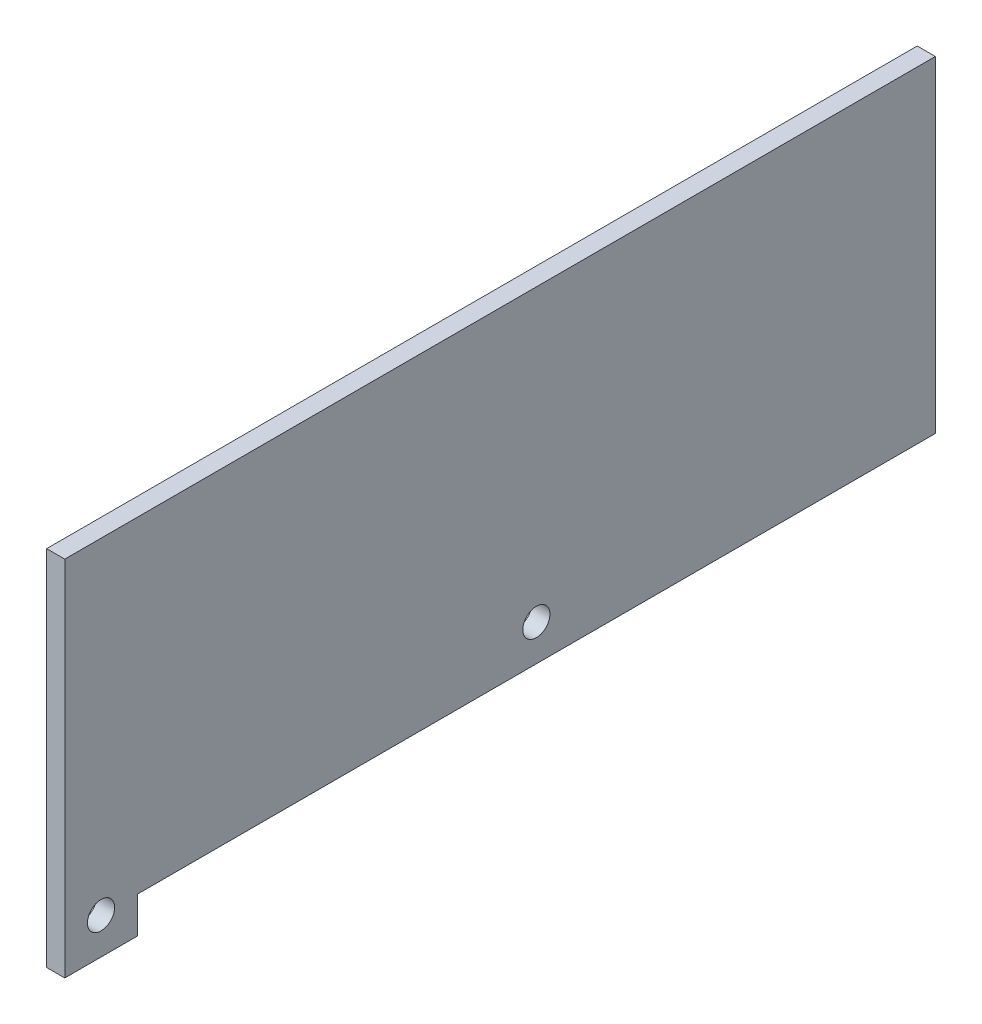
ISO-10303-21;
HEADER;
FILE_DESCRIPTION(('STEP AP214'),'2;1');
FILE_NAME('part.step','',(''),(''),'','','');
FILE_SCHEMA(('AUTOMOTIVE_DESIGN { 1 0 10303 214 1 1 1 1 }'));
ENDSEC;
DATA;
#1=APPLICATION_CONTEXT('core data for automotive mechanical design processes');
#2=APPLICATION_PROTOCOL_DEFINITION('international standard','automotive_design',2000,#1);
#3=PRODUCT_CONTEXT('',#1,'mechanical');
#4=PRODUCT('Part','Part','',(#3));
#5=PRODUCT_RELATED_PRODUCT_CATEGORY('part','',(#4));
#6=PRODUCT_DEFINITION_FORMATION('','',#4);
#7=PRODUCT_DEFINITION_CONTEXT('part definition',#1,'design');
#8=PRODUCT_DEFINITION('design','',#6,#7);
#9=PRODUCT_DEFINITION_SHAPE('','',#8);
#10=(LENGTH_UNIT() NAMED_UNIT(*) SI_UNIT(.MILLI.,.METRE.));
#11=(NAMED_UNIT(*) PLANE_ANGLE_UNIT() SI_UNIT($,.RADIAN.));
#12=(NAMED_UNIT(*) SI_UNIT($,.STERADIAN.) SOLID_ANGLE_UNIT());
#13=UNCERTAINTY_MEASURE_WITH_UNIT(LENGTH_MEASURE(1.E-05),#10,'distance_accuracy_value','');
#14=(GEOMETRIC_REPRESENTATION_CONTEXT(3) GLOBAL_UNCERTAINTY_ASSIGNED_CONTEXT((#13)) GLOBAL_UNIT_ASSIGNED_CONTEXT((#10,
#11,#12)) REPRESENTATION_CONTEXT('',''));
#15=CARTESIAN_POINT('',(0.,0.,0.));
#16=DIRECTION('',(0.,0.,1.));
#17=DIRECTION('',(1.,0.,0.));
#18=AXIS2_PLACEMENT_3D('',#15,#16,#17);
#19=CARTESIAN_POINT('',(6.35,254.,0.));
#20=DIRECTION('',(0.,0.,-1.));
#21=DIRECTION('',(0.,1.,0.));
#22=AXIS2_PLACEMENT_3D('',#19,#20,#21);
#23=PLANE('',#22);
#24=DIRECTION('',(0.,-1.,0.));
#25=VECTOR('',#24,1.);
#26=CARTESIAN_POINT('',(-6.35,254.,0.));
#27=LINE('',#26,#25);
#28=CARTESIAN_POINT('',(-6.35,254.,0.));
#29=VERTEX_POINT('',#28);
#30=CARTESIAN_POINT('',(-6.35,0.,0.));
#31=VERTEX_POINT('',#30);
#32=EDGE_CURVE('E117',#29,#31,#27,.T.);
#33=ORIENTED_EDGE('',*,*,#32,.T.);
#34=DIRECTION('',(-1.,0.,0.));
#35=VECTOR('',#34,1.);
#36=CARTESIAN_POINT('',(6.35,0.,0.));
#37=LINE('',#36,#35);
#38=CARTESIAN_POINT('',(6.35,0.,0.));
#39=VERTEX_POINT('',#38);
#40=EDGE_CURVE('E11',#39,#31,#37,.T.);
#41=ORIENTED_EDGE('',*,*,#40,.F.);
#42=DIRECTION('',(0.,-1.,0.));
#43=VECTOR('',#42,1.);
#44=CARTESIAN_POINT('',(6.35,254.,0.));
#45=LINE('',#44,#43);
#46=CARTESIAN_POINT('',(6.35,254.,0.));
#47=VERTEX_POINT('',#46);
#48=EDGE_CURVE('E128',#47,#39,#45,.T.);
#49=ORIENTED_EDGE('',*,*,#48,.F.);
#50=DIRECTION('',(-1.,0.,0.));
#51=VECTOR('',#50,1.);
#52=CARTESIAN_POINT('',(6.35,254.,0.));
#53=LINE('',#52,#51);
#54=EDGE_CURVE('E113',#47,#29,#53,.T.);
#55=ORIENTED_EDGE('',*,*,#54,.T.);
#56=EDGE_LOOP('',(#33,#41,#49,#55));
#57=FACE_BOUND('',#56,.T.);
#58=ADVANCED_FACE('F33',(#57),#23,.F.);
#59=CARTESIAN_POINT('',(6.35,0.,0.));
#60=DIRECTION('',(0.,1.,0.));
#61=DIRECTION('',(0.,0.,1.));
#62=AXIS2_PLACEMENT_3D('',#59,#60,#61);
#63=PLANE('',#62);
#64=DIRECTION('',(0.,0.,-1.));
#65=VECTOR('',#64,1.);
#66=CARTESIAN_POINT('',(-6.35,0.,0.));
#67=LINE('',#66,#65);
#68=CARTESIAN_POINT('',(-6.35,0.,-50.8));
#69=VERTEX_POINT('',#68);
#70=EDGE_CURVE('E120',#31,#69,#67,.T.);
#71=ORIENTED_EDGE('',*,*,#70,.T.);
#72=DIRECTION('',(-1.,0.,0.));
#73=VECTOR('',#72,1.);
#74=CARTESIAN_POINT('',(6.35,0.,-50.8));
#75=LINE('',#74,#73);
#76=CARTESIAN_POINT('',(6.35,0.,-50.8));
#77=VERTEX_POINT('',#76);
#78=EDGE_CURVE('E41',#77,#69,#75,.T.);
#79=ORIENTED_EDGE('',*,*,#78,.F.);
#80=DIRECTION('',(0.,0.,-1.));
#81=VECTOR('',#80,1.);
#82=CARTESIAN_POINT('',(6.35,0.,0.));
#83=LINE('',#82,#81);
#84=EDGE_CURVE('E86',#39,#77,#83,.T.);
#85=ORIENTED_EDGE('',*,*,#84,.F.);
#86=ORIENTED_EDGE('',*,*,#40,.T.);
#87=EDGE_LOOP('',(#71,#79,#85,#86));
#88=FACE_BOUND('',#87,.T.);
#89=ADVANCED_FACE('F153',(#88),#63,.F.);
#90=CARTESIAN_POINT('',(6.35,0.,-50.8));
#91=DIRECTION('',(0.,0.,1.));
#92=DIRECTION('',(1.,0.,0.));
#93=AXIS2_PLACEMENT_3D('',#90,#91,#92);
#94=PLANE('',#93);
#95=DIRECTION('',(0.,1.,0.));
#96=VECTOR('',#95,1.);
#97=CARTESIAN_POINT('',(-6.35,0.,-50.8));
#98=LINE('',#97,#96);
#99=CARTESIAN_POINT('',(-6.35,25.4,-50.8));
#100=VERTEX_POINT('',#99);
#101=EDGE_CURVE('E123',#69,#100,#98,.T.);
#102=ORIENTED_EDGE('',*,*,#101,.T.);
#103=DIRECTION('',(-1.,0.,0.));
#104=VECTOR('',#103,1.);
#105=CARTESIAN_POINT('',(6.35,25.4,-50.8));
#106=LINE('',#105,#104);
#107=CARTESIAN_POINT('',(6.35,25.4,-50.8));
#108=VERTEX_POINT('',#107);
#109=EDGE_CURVE('E108',#108,#100,#106,.T.);
#110=ORIENTED_EDGE('',*,*,#109,.F.);
#111=DIRECTION('',(0.,1.,0.));
#112=VECTOR('',#111,1.);
#113=CARTESIAN_POINT('',(6.35,0.,-50.8));
#114=LINE('',#113,#112);
#115=EDGE_CURVE('E99',#77,#108,#114,.T.);
#116=ORIENTED_EDGE('',*,*,#115,.F.);
#117=ORIENTED_EDGE('',*,*,#78,.T.);
#118=EDGE_LOOP('',(#102,#110,#116,#117));
#119=FACE_BOUND('',#118,.T.);
#120=ADVANCED_FACE('F134',(#119),#94,.F.);
#121=CARTESIAN_POINT('',(6.35,25.4,-50.8));
#122=DIRECTION('',(0.,1.,0.));
#123=DIRECTION('',(0.,0.,1.));
#124=AXIS2_PLACEMENT_3D('',#121,#122,#123);
#125=PLANE('',#124);
#126=DIRECTION('',(0.,0.,-1.));
#127=VECTOR('',#126,1.);
#128=CARTESIAN_POINT('',(-6.35,25.4,-50.8));
#129=LINE('',#128,#127);
#130=CARTESIAN_POINT('',(-6.35,25.4,-609.6));
#131=VERTEX_POINT('',#130);
#132=EDGE_CURVE('E107',#100,#131,#129,.T.);
#133=ORIENTED_EDGE('',*,*,#132,.T.);
#134=DIRECTION('',(-1.,0.,0.));
#135=VECTOR('',#134,1.);
#136=CARTESIAN_POINT('',(6.35,25.4,-609.6));
#137=LINE('',#136,#135);
#138=CARTESIAN_POINT('',(6.35,25.4,-609.6));
#139=VERTEX_POINT('',#138);
#140=EDGE_CURVE('E104',#139,#131,#137,.T.);
#141=ORIENTED_EDGE('',*,*,#140,.F.);
#142=DIRECTION('',(0.,0.,-1.));
#143=VECTOR('',#142,1.);
#144=CARTESIAN_POINT('',(6.35,25.4,-50.8));
#145=LINE('',#144,#143);
#146=EDGE_CURVE('E93',#108,#139,#145,.T.);
#147=ORIENTED_EDGE('',*,*,#146,.F.);
#148=ORIENTED_EDGE('',*,*,#109,.T.);
#149=EDGE_LOOP('',(#133,#141,#147,#148));
#150=FACE_BOUND('',#149,.T.);
#151=ADVANCED_FACE('F105',(#150),#125,.F.);
#152=CARTESIAN_POINT('',(6.35,25.4,-609.6));
#153=DIRECTION('',(0.,0.,1.));
#154=DIRECTION('',(1.,0.,0.));
#155=AXIS2_PLACEMENT_3D('',#152,#153,#154);
#156=PLANE('',#155);
#157=DIRECTION('',(0.,1.,0.));
#158=VECTOR('',#157,1.);
#159=CARTESIAN_POINT('',(-6.35,25.4,-609.6));
#160=LINE('',#159,#158);
#161=CARTESIAN_POINT('',(-6.35,254.,-609.6));
#162=VERTEX_POINT('',#161);
#163=EDGE_CURVE('E72',#131,#162,#160,.T.);
#164=ORIENTED_EDGE('',*,*,#163,.T.);
#165=DIRECTION('',(-1.,0.,0.));
#166=VECTOR('',#165,1.);
#167=CARTESIAN_POINT('',(6.35,254.,-609.6));
#168=LINE('',#167,#166);
#169=CARTESIAN_POINT('',(6.35,254.,-609.6));
#170=VERTEX_POINT('',#169);
#171=EDGE_CURVE('E109',#170,#162,#168,.T.);
#172=ORIENTED_EDGE('',*,*,#171,.F.);
#173=DIRECTION('',(0.,1.,0.));
#174=VECTOR('',#173,1.);
#175=CARTESIAN_POINT('',(6.35,25.4,-609.6));
#176=LINE('',#175,#174);
#177=EDGE_CURVE('E97',#139,#170,#176,.T.);
#178=ORIENTED_EDGE('',*,*,#177,.F.);
#179=ORIENTED_EDGE('',*,*,#140,.T.);
#180=EDGE_LOOP('',(#164,#172,#178,#179));
#181=FACE_BOUND('',#180,.T.);
#182=ADVANCED_FACE('F111',(#181),#156,.F.);
#183=CARTESIAN_POINT('',(6.35,254.,-609.6));
#184=DIRECTION('',(0.,-1.,0.));
#185=DIRECTION('',(0.,0.,-1.));
#186=AXIS2_PLACEMENT_3D('',#183,#184,#185);
#187=PLANE('',#186);
#188=DIRECTION('',(0.,0.,1.));
#189=VECTOR('',#188,1.);
#190=CARTESIAN_POINT('',(-6.35,254.,-609.6));
#191=LINE('',#190,#189);
#192=EDGE_CURVE('E78',#162,#29,#191,.T.);
#193=ORIENTED_EDGE('',*,*,#192,.T.);
#194=ORIENTED_EDGE('',*,*,#54,.F.);
#195=DIRECTION('',(0.,0.,1.));
#196=VECTOR('',#195,1.);
#197=CARTESIAN_POINT('',(6.35,254.,-609.6));
#198=LINE('',#197,#196);
#199=EDGE_CURVE('E49',#170,#47,#198,.T.);
#200=ORIENTED_EDGE('',*,*,#199,.F.);
#201=ORIENTED_EDGE('',*,*,#171,.T.);
#202=EDGE_LOOP('',(#193,#194,#200,#201));
#203=FACE_BOUND('',#202,.T.);
#204=ADVANCED_FACE('F141',(#203),#187,.F.);
#205=CARTESIAN_POINT('',(6.35,0.,0.));
#206=DIRECTION('',(1.,0.,0.));
#207=DIRECTION('',(0.,0.,-1.));
#208=AXIS2_PLACEMENT_3D('',#205,#206,#207);
#209=PLANE('',#208);
#210=CARTESIAN_POINT('',(6.35,50.8,-330.2));
#211=DIRECTION('',(1.,0.,0.));
#212=DIRECTION('',(0.,0.,-1.));
#213=AXIS2_PLACEMENT_3D('',#210,#211,#212);
#214=CIRCLE('',#213,9.52500000000002);
#215=CARTESIAN_POINT('',(6.35,50.8,-339.725));
#216=VERTEX_POINT('',#215);
#217=EDGE_CURVE('E216',#216,#216,#214,.T.);
#218=ORIENTED_EDGE('',*,*,#217,.F.);
#219=EDGE_LOOP('',(#218));
#220=FACE_BOUND('',#219,.T.);
#221=CARTESIAN_POINT('',(6.35,25.4,-25.4));
#222=DIRECTION('',(1.,0.,0.));
#223=DIRECTION('',(0.,0.,-1.));
#224=AXIS2_PLACEMENT_3D('',#221,#222,#223);
#225=CIRCLE('',#224,9.525);
#226=CARTESIAN_POINT('',(6.35,25.4,-34.925));
#227=VERTEX_POINT('',#226);
#228=EDGE_CURVE('E220',#227,#227,#225,.T.);
#229=ORIENTED_EDGE('',*,*,#228,.F.);
#230=EDGE_LOOP('',(#229));
#231=FACE_BOUND('',#230,.T.);
#232=ORIENTED_EDGE('',*,*,#48,.T.);
#233=ORIENTED_EDGE('',*,*,#84,.T.);
#234=ORIENTED_EDGE('',*,*,#115,.T.);
#235=ORIENTED_EDGE('',*,*,#146,.T.);
#236=ORIENTED_EDGE('',*,*,#177,.T.);
#237=ORIENTED_EDGE('',*,*,#199,.T.);
#238=EDGE_LOOP('',(#232,#233,#234,#235,#236,#237));
#239=FACE_BOUND('',#238,.T.);
#240=ADVANCED_FACE('F95',(#220,#231,#239),#209,.T.);
#241=CARTESIAN_POINT('',(-6.35,0.,0.));
#242=DIRECTION('',(1.,0.,0.));
#243=DIRECTION('',(0.,0.,-1.));
#244=AXIS2_PLACEMENT_3D('',#241,#242,#243);
#245=PLANE('',#244);
#246=CARTESIAN_POINT('',(-6.35,50.8,-330.2));
#247=DIRECTION('',(1.,0.,0.));
#248=DIRECTION('',(0.,0.,-1.));
#249=AXIS2_PLACEMENT_3D('',#246,#247,#248);
#250=CIRCLE('',#249,9.52500000000002);
#251=CARTESIAN_POINT('',(-6.35,50.8,-339.725));
#252=VERTEX_POINT('',#251);
#253=EDGE_CURVE('E219',#252,#252,#250,.F.);
#254=ORIENTED_EDGE('',*,*,#253,.F.);
#255=EDGE_LOOP('',(#254));
#256=FACE_BOUND('',#255,.T.);
#257=CARTESIAN_POINT('',(-6.35,25.4,-25.4));
#258=DIRECTION('',(1.,0.,0.));
#259=DIRECTION('',(0.,0.,-1.));
#260=AXIS2_PLACEMENT_3D('',#257,#258,#259);
#261=CIRCLE('',#260,9.525);
#262=CARTESIAN_POINT('',(-6.35,25.4,-34.925));
#263=VERTEX_POINT('',#262);
#264=EDGE_CURVE('E121',#263,#263,#261,.F.);
#265=ORIENTED_EDGE('',*,*,#264,.F.);
#266=EDGE_LOOP('',(#265));
#267=FACE_BOUND('',#266,.T.);
#268=ORIENTED_EDGE('',*,*,#32,.F.);
#269=ORIENTED_EDGE('',*,*,#192,.F.);
#270=ORIENTED_EDGE('',*,*,#163,.F.);
#271=ORIENTED_EDGE('',*,*,#132,.F.);
#272=ORIENTED_EDGE('',*,*,#101,.F.);
#273=ORIENTED_EDGE('',*,*,#70,.F.);
#274=EDGE_LOOP('',(#268,#269,#270,#271,#272,#273));
#275=FACE_BOUND('',#274,.T.);
#276=ADVANCED_FACE('F137',(#256,#267,#275),#245,.F.);
#277=CARTESIAN_POINT('',(-6.351,25.4,-25.4));
#278=DIRECTION('',(1.,0.,0.));
#279=DIRECTION('',(0.,0.,-1.));
#280=AXIS2_PLACEMENT_3D('',#277,#278,#279);
#281=CYLINDRICAL_SURFACE('',#280,9.525);
#282=ORIENTED_EDGE('',*,*,#228,.T.);
#283=EDGE_LOOP('',(#282));
#284=FACE_BOUND('',#283,.T.);
#285=ORIENTED_EDGE('',*,*,#264,.T.);
#286=EDGE_LOOP('',(#285));
#287=FACE_BOUND('',#286,.T.);
#288=ADVANCED_FACE('F190',(#284,#287),#281,.F.);
#289=CARTESIAN_POINT('',(-6.351,50.8,-330.2));
#290=DIRECTION('',(1.,0.,0.));
#291=DIRECTION('',(0.,0.,-1.));
#292=AXIS2_PLACEMENT_3D('',#289,#290,#291);
#293=CYLINDRICAL_SURFACE('',#292,9.52500000000002);
#294=ORIENTED_EDGE('',*,*,#217,.T.);
#295=EDGE_LOOP('',(#294));
#296=FACE_BOUND('',#295,.T.);
#297=ORIENTED_EDGE('',*,*,#253,.T.);
#298=EDGE_LOOP('',(#297));
#299=FACE_BOUND('',#298,.T.);
#300=ADVANCED_FACE('F199',(#296,#299),#293,.F.);
#301=CLOSED_SHELL('',(#58,#89,#120,#151,#182,#204,#240,#276,#288,#300));
#302=MANIFOLD_SOLID_BREP('B2',#301);
#303=ADVANCED_BREP_SHAPE_REPRESENTATION('',(#18,#302),#14);
#304=SHAPE_DEFINITION_REPRESENTATION(#9,#303);
ENDSEC;
END-ISO-10303-21;
